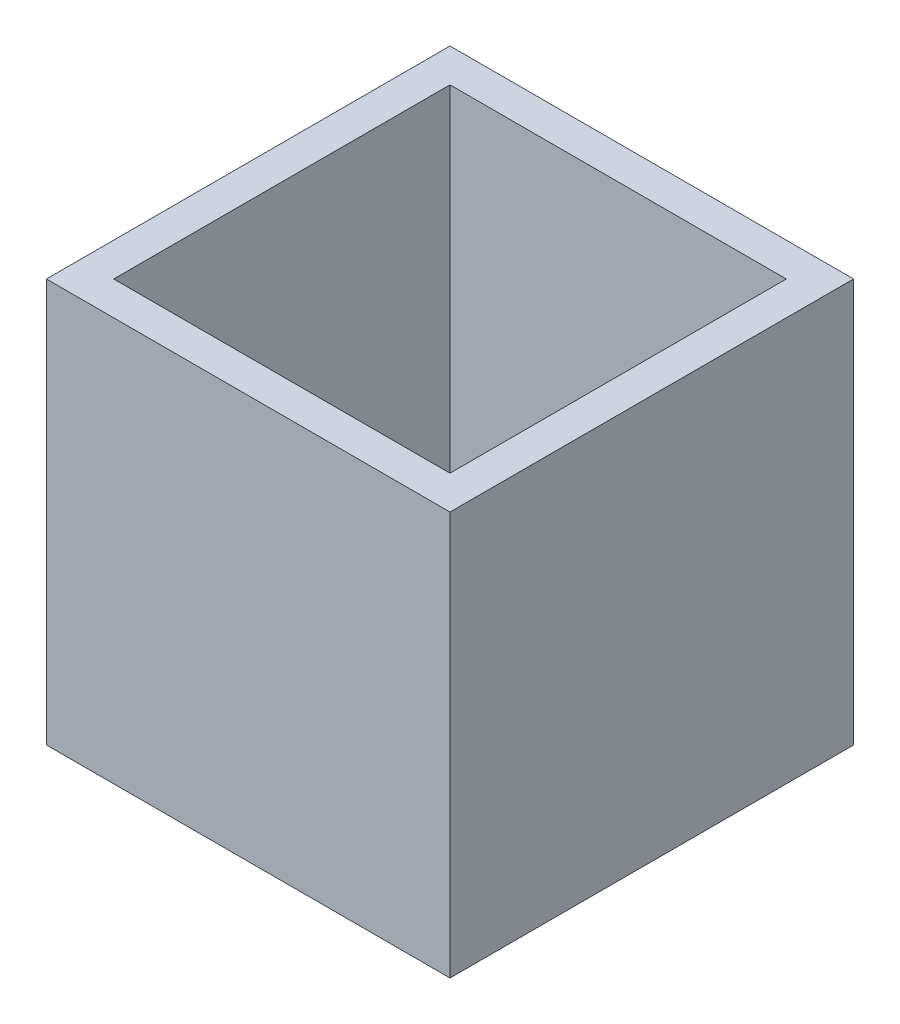
ISO-10303-21;
HEADER;
FILE_DESCRIPTION(('STEP AP214'),'2;1');
FILE_NAME('part.step','',(''),(''),'','','');
FILE_SCHEMA(('AUTOMOTIVE_DESIGN { 1 0 10303 214 1 1 1 1 }'));
ENDSEC;
DATA;
#1=APPLICATION_CONTEXT('core data for automotive mechanical design processes');
#2=APPLICATION_PROTOCOL_DEFINITION('international standard','automotive_design',2000,#1);
#3=PRODUCT_CONTEXT('',#1,'mechanical');
#4=PRODUCT('Part','Part','',(#3));
#5=PRODUCT_RELATED_PRODUCT_CATEGORY('part','',(#4));
#6=PRODUCT_DEFINITION_FORMATION('','',#4);
#7=PRODUCT_DEFINITION_CONTEXT('part definition',#1,'design');
#8=PRODUCT_DEFINITION('design','',#6,#7);
#9=PRODUCT_DEFINITION_SHAPE('','',#8);
#10=(LENGTH_UNIT() NAMED_UNIT(*) SI_UNIT(.MILLI.,.METRE.));
#11=(NAMED_UNIT(*) PLANE_ANGLE_UNIT() SI_UNIT($,.RADIAN.));
#12=(NAMED_UNIT(*) SI_UNIT($,.STERADIAN.) SOLID_ANGLE_UNIT());
#13=UNCERTAINTY_MEASURE_WITH_UNIT(LENGTH_MEASURE(1.E-05),#10,'distance_accuracy_value','');
#14=(GEOMETRIC_REPRESENTATION_CONTEXT(3) GLOBAL_UNCERTAINTY_ASSIGNED_CONTEXT((#13)) GLOBAL_UNIT_ASSIGNED_CONTEXT((#10,
#11,#12)) REPRESENTATION_CONTEXT('',''));
#15=CARTESIAN_POINT('',(0.,0.,0.));
#16=DIRECTION('',(0.,0.,1.));
#17=DIRECTION('',(1.,0.,0.));
#18=AXIS2_PLACEMENT_3D('',#15,#16,#17);
#19=CARTESIAN_POINT('',(0.,12.,-12.));
#20=DIRECTION('',(1.,0.,0.));
#21=DIRECTION('',(0.,0.,-1.));
#22=AXIS2_PLACEMENT_3D('',#19,#20,#21);
#23=PLANE('',#22);
#24=DIRECTION('',(0.,0.,1.));
#25=VECTOR('',#24,1.);
#26=CARTESIAN_POINT('',(0.,0.,-12.));
#27=LINE('',#26,#25);
#28=CARTESIAN_POINT('',(0.,0.,-12.));
#29=VERTEX_POINT('',#28);
#30=CARTESIAN_POINT('',(0.,0.,0.));
#31=VERTEX_POINT('',#30);
#32=EDGE_CURVE('E151',#29,#31,#27,.T.);
#33=ORIENTED_EDGE('',*,*,#32,.T.);
#34=DIRECTION('',(0.,-1.,0.));
#35=VECTOR('',#34,1.);
#36=CARTESIAN_POINT('',(0.,12.,0.));
#37=LINE('',#36,#35);
#38=CARTESIAN_POINT('',(0.,12.,0.));
#39=VERTEX_POINT('',#38);
#40=EDGE_CURVE('E11',#39,#31,#37,.T.);
#41=ORIENTED_EDGE('',*,*,#40,.F.);
#42=DIRECTION('',(0.,0.,1.));
#43=VECTOR('',#42,1.);
#44=CARTESIAN_POINT('',(0.,12.,-12.));
#45=LINE('',#44,#43);
#46=CARTESIAN_POINT('',(0.,12.,-12.));
#47=VERTEX_POINT('',#46);
#48=EDGE_CURVE('E157',#47,#39,#45,.T.);
#49=ORIENTED_EDGE('',*,*,#48,.F.);
#50=DIRECTION('',(0.,-1.,0.));
#51=VECTOR('',#50,1.);
#52=CARTESIAN_POINT('',(0.,12.,-12.));
#53=LINE('',#52,#51);
#54=EDGE_CURVE('E171',#47,#29,#53,.T.);
#55=ORIENTED_EDGE('',*,*,#54,.T.);
#56=EDGE_LOOP('',(#33,#41,#49,#55));
#57=FACE_BOUND('',#56,.T.);
#58=ADVANCED_FACE('F43',(#57),#23,.F.);
#59=CARTESIAN_POINT('',(0.,12.,0.));
#60=DIRECTION('',(0.,0.,-1.));
#61=DIRECTION('',(-1.,0.,0.));
#62=AXIS2_PLACEMENT_3D('',#59,#60,#61);
#63=PLANE('',#62);
#64=DIRECTION('',(1.,0.,0.));
#65=VECTOR('',#64,1.);
#66=CARTESIAN_POINT('',(0.,0.,0.));
#67=LINE('',#66,#65);
#68=CARTESIAN_POINT('',(12.,0.,0.));
#69=VERTEX_POINT('',#68);
#70=EDGE_CURVE('E175',#31,#69,#67,.T.);
#71=ORIENTED_EDGE('',*,*,#70,.T.);
#72=DIRECTION('',(0.,-1.,0.));
#73=VECTOR('',#72,1.);
#74=CARTESIAN_POINT('',(12.,12.,0.));
#75=LINE('',#74,#73);
#76=CARTESIAN_POINT('',(12.,12.,0.));
#77=VERTEX_POINT('',#76);
#78=EDGE_CURVE('E51',#77,#69,#75,.T.);
#79=ORIENTED_EDGE('',*,*,#78,.F.);
#80=DIRECTION('',(1.,0.,0.));
#81=VECTOR('',#80,1.);
#82=CARTESIAN_POINT('',(0.,12.,0.));
#83=LINE('',#82,#81);
#84=EDGE_CURVE('E161',#39,#77,#83,.T.);
#85=ORIENTED_EDGE('',*,*,#84,.F.);
#86=ORIENTED_EDGE('',*,*,#40,.T.);
#87=EDGE_LOOP('',(#71,#79,#85,#86));
#88=FACE_BOUND('',#87,.T.);
#89=ADVANCED_FACE('F209',(#88),#63,.F.);
#90=CARTESIAN_POINT('',(12.,12.,-12.));
#91=DIRECTION('',(-1.,0.,0.));
#92=DIRECTION('',(0.,0.,1.));
#93=AXIS2_PLACEMENT_3D('',#90,#91,#92);
#94=PLANE('',#93);
#95=DIRECTION('',(0.,0.,-1.));
#96=VECTOR('',#95,1.);
#97=CARTESIAN_POINT('',(12.,0.,-12.));
#98=LINE('',#97,#96);
#99=CARTESIAN_POINT('',(12.,0.,-12.));
#100=VERTEX_POINT('',#99);
#101=EDGE_CURVE('E178',#69,#100,#98,.T.);
#102=ORIENTED_EDGE('',*,*,#101,.T.);
#103=DIRECTION('',(0.,-1.,0.));
#104=VECTOR('',#103,1.);
#105=CARTESIAN_POINT('',(12.,12.,-12.));
#106=LINE('',#105,#104);
#107=CARTESIAN_POINT('',(12.,12.,-12.));
#108=VERTEX_POINT('',#107);
#109=EDGE_CURVE('E186',#108,#100,#106,.T.);
#110=ORIENTED_EDGE('',*,*,#109,.F.);
#111=DIRECTION('',(0.,0.,-1.));
#112=VECTOR('',#111,1.);
#113=CARTESIAN_POINT('',(12.,12.,-12.));
#114=LINE('',#113,#112);
#115=EDGE_CURVE('E165',#77,#108,#114,.T.);
#116=ORIENTED_EDGE('',*,*,#115,.F.);
#117=ORIENTED_EDGE('',*,*,#78,.T.);
#118=EDGE_LOOP('',(#102,#110,#116,#117));
#119=FACE_BOUND('',#118,.T.);
#120=ADVANCED_FACE('F195',(#119),#94,.F.);
#121=CARTESIAN_POINT('',(0.,12.,-12.));
#122=DIRECTION('',(0.,0.,1.));
#123=DIRECTION('',(1.,0.,0.));
#124=AXIS2_PLACEMENT_3D('',#121,#122,#123);
#125=PLANE('',#124);
#126=DIRECTION('',(-1.,0.,0.));
#127=VECTOR('',#126,1.);
#128=CARTESIAN_POINT('',(0.,0.,-12.));
#129=LINE('',#128,#127);
#130=EDGE_CURVE('E162',#100,#29,#129,.T.);
#131=ORIENTED_EDGE('',*,*,#130,.T.);
#132=ORIENTED_EDGE('',*,*,#54,.F.);
#133=DIRECTION('',(-1.,0.,0.));
#134=VECTOR('',#133,1.);
#135=CARTESIAN_POINT('',(0.,12.,-12.));
#136=LINE('',#135,#134);
#137=EDGE_CURVE('E168',#108,#47,#136,.T.);
#138=ORIENTED_EDGE('',*,*,#137,.F.);
#139=ORIENTED_EDGE('',*,*,#109,.T.);
#140=EDGE_LOOP('',(#131,#132,#138,#139));
#141=FACE_BOUND('',#140,.T.);
#142=ADVANCED_FACE('F202',(#141),#125,.F.);
#143=CARTESIAN_POINT('',(0.,12.,0.));
#144=DIRECTION('',(0.,1.,0.));
#145=DIRECTION('',(0.,0.,1.));
#146=AXIS2_PLACEMENT_3D('',#143,#144,#145);
#147=PLANE('',#146);
#148=DIRECTION('',(0.,0.,-1.));
#149=VECTOR('',#148,1.);
#150=CARTESIAN_POINT('',(11.,12.,-11.));
#151=LINE('',#150,#149);
#152=CARTESIAN_POINT('',(11.,12.,-1.));
#153=VERTEX_POINT('',#152);
#154=CARTESIAN_POINT('',(11.,12.,-11.));
#155=VERTEX_POINT('',#154);
#156=EDGE_CURVE('E58',#153,#155,#151,.T.);
#157=ORIENTED_EDGE('',*,*,#156,.F.);
#158=DIRECTION('',(1.,0.,0.));
#159=VECTOR('',#158,1.);
#160=CARTESIAN_POINT('',(11.,12.,-1.));
#161=LINE('',#160,#159);
#162=CARTESIAN_POINT('',(0.999999999999999,12.,-0.999999999999999));
#163=VERTEX_POINT('',#162);
#164=EDGE_CURVE('E129',#163,#153,#161,.T.);
#165=ORIENTED_EDGE('',*,*,#164,.F.);
#166=DIRECTION('',(0.,0.,1.));
#167=VECTOR('',#166,1.);
#168=CARTESIAN_POINT('',(0.999999999999997,12.,-11.));
#169=LINE('',#168,#167);
#170=CARTESIAN_POINT('',(0.999999999999997,12.,-11.));
#171=VERTEX_POINT('',#170);
#172=EDGE_CURVE('E133',#171,#163,#169,.T.);
#173=ORIENTED_EDGE('',*,*,#172,.F.);
#174=DIRECTION('',(-1.,0.,0.));
#175=VECTOR('',#174,1.);
#176=CARTESIAN_POINT('',(11.,12.,-11.));
#177=LINE('',#176,#175);
#178=EDGE_CURVE('E142',#155,#171,#177,.T.);
#179=ORIENTED_EDGE('',*,*,#178,.F.);
#180=EDGE_LOOP('',(#157,#165,#173,#179));
#181=FACE_BOUND('',#180,.T.);
#182=ORIENTED_EDGE('',*,*,#48,.T.);
#183=ORIENTED_EDGE('',*,*,#84,.T.);
#184=ORIENTED_EDGE('',*,*,#115,.T.);
#185=ORIENTED_EDGE('',*,*,#137,.T.);
#186=EDGE_LOOP('',(#182,#183,#184,#185));
#187=FACE_BOUND('',#186,.T.);
#188=ADVANCED_FACE('F208',(#181,#187),#147,.T.);
#189=CARTESIAN_POINT('',(0.,0.,0.));
#190=DIRECTION('',(0.,1.,0.));
#191=DIRECTION('',(0.,0.,1.));
#192=AXIS2_PLACEMENT_3D('',#189,#190,#191);
#193=PLANE('',#192);
#194=DIRECTION('',(1.,0.,0.));
#195=VECTOR('',#194,1.);
#196=CARTESIAN_POINT('',(11.,0.,-1.));
#197=LINE('',#196,#195);
#198=CARTESIAN_POINT('',(0.999999999999999,0.,-0.999999999999999));
#199=VERTEX_POINT('',#198);
#200=CARTESIAN_POINT('',(11.,0.,-1.));
#201=VERTEX_POINT('',#200);
#202=EDGE_CURVE('E117',#199,#201,#197,.T.);
#203=ORIENTED_EDGE('',*,*,#202,.T.);
#204=DIRECTION('',(0.,0.,-1.));
#205=VECTOR('',#204,1.);
#206=CARTESIAN_POINT('',(11.,0.,-11.));
#207=LINE('',#206,#205);
#208=CARTESIAN_POINT('',(11.,0.,-11.));
#209=VERTEX_POINT('',#208);
#210=EDGE_CURVE('E110',#201,#209,#207,.T.);
#211=ORIENTED_EDGE('',*,*,#210,.T.);
#212=DIRECTION('',(-1.,0.,0.));
#213=VECTOR('',#212,1.);
#214=CARTESIAN_POINT('',(11.,0.,-11.));
#215=LINE('',#214,#213);
#216=CARTESIAN_POINT('',(0.999999999999997,0.,-11.));
#217=VERTEX_POINT('',#216);
#218=EDGE_CURVE('E120',#209,#217,#215,.T.);
#219=ORIENTED_EDGE('',*,*,#218,.T.);
#220=DIRECTION('',(0.,0.,1.));
#221=VECTOR('',#220,1.);
#222=CARTESIAN_POINT('',(0.999999999999997,0.,-11.));
#223=LINE('',#222,#221);
#224=EDGE_CURVE('E66',#217,#199,#223,.T.);
#225=ORIENTED_EDGE('',*,*,#224,.T.);
#226=EDGE_LOOP('',(#203,#211,#219,#225));
#227=FACE_BOUND('',#226,.T.);
#228=ORIENTED_EDGE('',*,*,#32,.F.);
#229=ORIENTED_EDGE('',*,*,#130,.F.);
#230=ORIENTED_EDGE('',*,*,#101,.F.);
#231=ORIENTED_EDGE('',*,*,#70,.F.);
#232=EDGE_LOOP('',(#228,#229,#230,#231));
#233=FACE_BOUND('',#232,.T.);
#234=ADVANCED_FACE('F125',(#227,#233),#193,.F.);
#235=CARTESIAN_POINT('',(11.,0.,-11.));
#236=DIRECTION('',(1.,0.,0.));
#237=DIRECTION('',(0.,0.,-1.));
#238=AXIS2_PLACEMENT_3D('',#235,#236,#237);
#239=PLANE('',#238);
#240=ORIENTED_EDGE('',*,*,#156,.T.);
#241=DIRECTION('',(0.,1.,0.));
#242=VECTOR('',#241,1.);
#243=CARTESIAN_POINT('',(11.,0.,-11.));
#244=LINE('',#243,#242);
#245=EDGE_CURVE('E106',#209,#155,#244,.T.);
#246=ORIENTED_EDGE('',*,*,#245,.F.);
#247=ORIENTED_EDGE('',*,*,#210,.F.);
#248=DIRECTION('',(0.,1.,0.));
#249=VECTOR('',#248,1.);
#250=CARTESIAN_POINT('',(11.,0.,-1.));
#251=LINE('',#250,#249);
#252=EDGE_CURVE('E148',#201,#153,#251,.T.);
#253=ORIENTED_EDGE('',*,*,#252,.T.);
#254=EDGE_LOOP('',(#240,#246,#247,#253));
#255=FACE_BOUND('',#254,.T.);
#256=ADVANCED_FACE('F108',(#255),#239,.F.);
#257=CARTESIAN_POINT('',(11.,0.,-1.));
#258=DIRECTION('',(0.,0.,1.));
#259=DIRECTION('',(1.,0.,0.));
#260=AXIS2_PLACEMENT_3D('',#257,#258,#259);
#261=PLANE('',#260);
#262=ORIENTED_EDGE('',*,*,#164,.T.);
#263=ORIENTED_EDGE('',*,*,#252,.F.);
#264=ORIENTED_EDGE('',*,*,#202,.F.);
#265=DIRECTION('',(0.,1.,0.));
#266=VECTOR('',#265,1.);
#267=CARTESIAN_POINT('',(0.999999999999999,0.,-0.999999999999999));
#268=LINE('',#267,#266);
#269=EDGE_CURVE('E152',#199,#163,#268,.T.);
#270=ORIENTED_EDGE('',*,*,#269,.T.);
#271=EDGE_LOOP('',(#262,#263,#264,#270));
#272=FACE_BOUND('',#271,.T.);
#273=ADVANCED_FACE('F226',(#272),#261,.F.);
#274=CARTESIAN_POINT('',(0.999999999999997,0.,-11.));
#275=DIRECTION('',(-1.,0.,0.));
#276=DIRECTION('',(0.,0.,1.));
#277=AXIS2_PLACEMENT_3D('',#274,#275,#276);
#278=PLANE('',#277);
#279=ORIENTED_EDGE('',*,*,#172,.T.);
#280=ORIENTED_EDGE('',*,*,#269,.F.);
#281=ORIENTED_EDGE('',*,*,#224,.F.);
#282=DIRECTION('',(0.,1.,0.));
#283=VECTOR('',#282,1.);
#284=CARTESIAN_POINT('',(0.999999999999997,0.,-11.));
#285=LINE('',#284,#283);
#286=EDGE_CURVE('E116',#217,#171,#285,.T.);
#287=ORIENTED_EDGE('',*,*,#286,.T.);
#288=EDGE_LOOP('',(#279,#280,#281,#287));
#289=FACE_BOUND('',#288,.T.);
#290=ADVANCED_FACE('F229',(#289),#278,.F.);
#291=CARTESIAN_POINT('',(11.,0.,-11.));
#292=DIRECTION('',(0.,0.,-1.));
#293=DIRECTION('',(-1.,0.,0.));
#294=AXIS2_PLACEMENT_3D('',#291,#292,#293);
#295=PLANE('',#294);
#296=ORIENTED_EDGE('',*,*,#178,.T.);
#297=ORIENTED_EDGE('',*,*,#286,.F.);
#298=ORIENTED_EDGE('',*,*,#218,.F.);
#299=ORIENTED_EDGE('',*,*,#245,.T.);
#300=EDGE_LOOP('',(#296,#297,#298,#299));
#301=FACE_BOUND('',#300,.T.);
#302=ADVANCED_FACE('F121',(#301),#295,.F.);
#303=CLOSED_SHELL('',(#58,#89,#120,#142,#188,#234,#256,#273,#290,#302));
#304=MANIFOLD_SOLID_BREP('B2',#303);
#305=ADVANCED_BREP_SHAPE_REPRESENTATION('',(#18,#304),#14);
#306=SHAPE_DEFINITION_REPRESENTATION(#9,#305);
ENDSEC;
END-ISO-10303-21;
